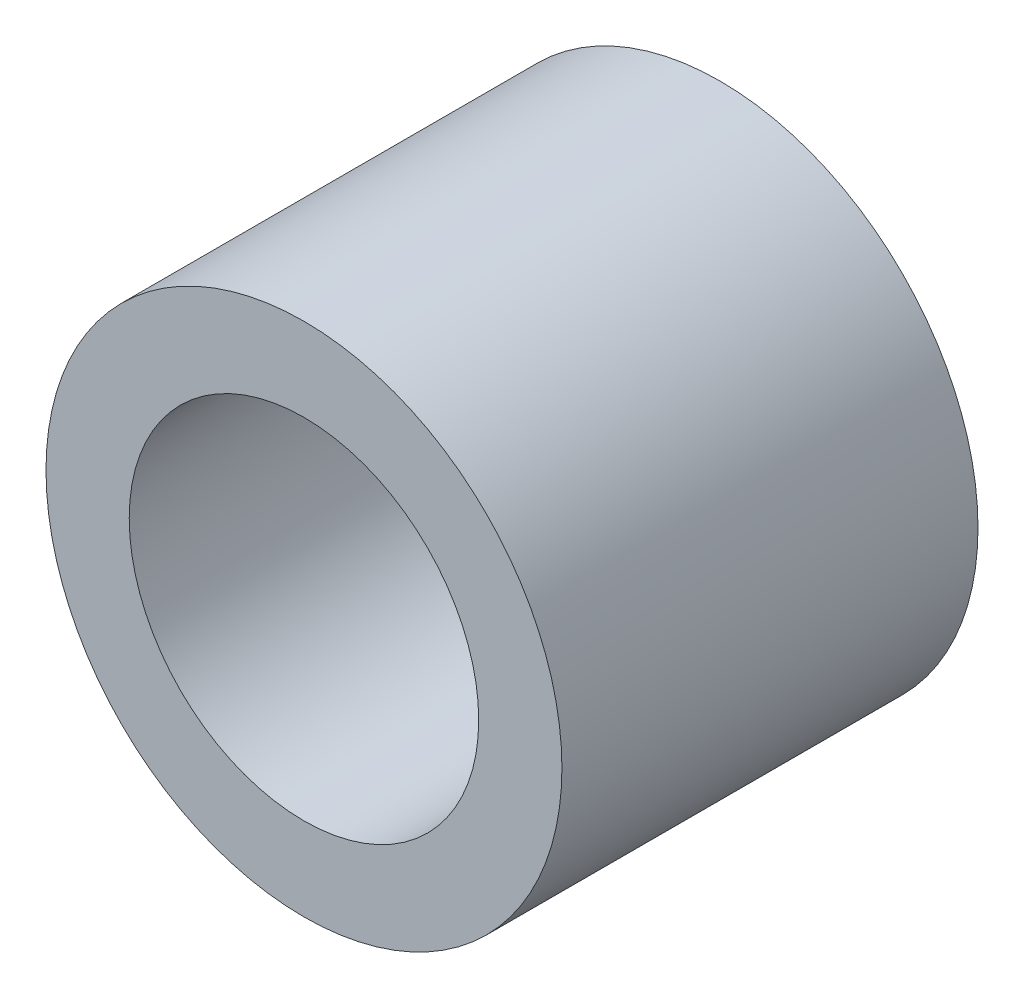
ISO-10303-21;
HEADER;
FILE_DESCRIPTION(('STEP AP214'),'2;1');
FILE_NAME('part.step','',(''),(''),'','','');
FILE_SCHEMA(('AUTOMOTIVE_DESIGN { 1 0 10303 214 1 1 1 1 }'));
ENDSEC;
DATA;
#1=APPLICATION_CONTEXT('core data for automotive mechanical design processes');
#2=APPLICATION_PROTOCOL_DEFINITION('international standard','automotive_design',2000,#1);
#3=PRODUCT_CONTEXT('',#1,'mechanical');
#4=PRODUCT('Part','Part','',(#3));
#5=PRODUCT_RELATED_PRODUCT_CATEGORY('part','',(#4));
#6=PRODUCT_DEFINITION_FORMATION('','',#4);
#7=PRODUCT_DEFINITION_CONTEXT('part definition',#1,'design');
#8=PRODUCT_DEFINITION('design','',#6,#7);
#9=PRODUCT_DEFINITION_SHAPE('','',#8);
#10=(LENGTH_UNIT() NAMED_UNIT(*) SI_UNIT(.MILLI.,.METRE.));
#11=(NAMED_UNIT(*) PLANE_ANGLE_UNIT() SI_UNIT($,.RADIAN.));
#12=(NAMED_UNIT(*) SI_UNIT($,.STERADIAN.) SOLID_ANGLE_UNIT());
#13=UNCERTAINTY_MEASURE_WITH_UNIT(LENGTH_MEASURE(1.E-05),#10,'distance_accuracy_value','');
#14=(GEOMETRIC_REPRESENTATION_CONTEXT(3) GLOBAL_UNCERTAINTY_ASSIGNED_CONTEXT((#13)) GLOBAL_UNIT_ASSIGNED_CONTEXT((#10,
#11,#12)) REPRESENTATION_CONTEXT('',''));
#15=CARTESIAN_POINT('',(0.,0.,0.));
#16=DIRECTION('',(0.,0.,1.));
#17=DIRECTION('',(1.,0.,0.));
#18=AXIS2_PLACEMENT_3D('',#15,#16,#17);
#19=CARTESIAN_POINT('',(0.,0.,5.));
#20=DIRECTION('',(0.,0.,1.));
#21=DIRECTION('',(1.,0.,0.));
#22=AXIS2_PLACEMENT_3D('',#19,#20,#21);
#23=PLANE('',#22);
#24=CARTESIAN_POINT('',(0.,0.,5.));
#25=DIRECTION('',(0.,0.,1.));
#26=DIRECTION('',(1.,0.,0.));
#27=AXIS2_PLACEMENT_3D('',#24,#25,#26);
#28=CIRCLE('',#27,3.1);
#29=CARTESIAN_POINT('',(3.1,0.,5.));
#30=VERTEX_POINT('',#29);
#31=EDGE_CURVE('E10',#30,#30,#28,.T.);
#32=ORIENTED_EDGE('',*,*,#31,.T.);
#33=EDGE_LOOP('',(#32));
#34=FACE_BOUND('',#33,.T.);
#35=CARTESIAN_POINT('',(0.,0.,5.));
#36=DIRECTION('',(0.,0.,1.));
#37=DIRECTION('',(1.,0.,0.));
#38=AXIS2_PLACEMENT_3D('',#35,#36,#37);
#39=CIRCLE('',#38,2.1);
#40=CARTESIAN_POINT('',(2.1,0.,5.));
#41=VERTEX_POINT('',#40);
#42=EDGE_CURVE('E43',#41,#41,#39,.T.);
#43=ORIENTED_EDGE('',*,*,#42,.F.);
#44=EDGE_LOOP('',(#43));
#45=FACE_BOUND('',#44,.T.);
#46=ADVANCED_FACE('F32',(#34,#45),#23,.T.);
#47=CARTESIAN_POINT('',(0.,0.,0.));
#48=DIRECTION('',(0.,0.,1.));
#49=DIRECTION('',(1.,0.,0.));
#50=AXIS2_PLACEMENT_3D('',#47,#48,#49);
#51=PLANE('',#50);
#52=CARTESIAN_POINT('',(0.,0.,0.));
#53=DIRECTION('',(0.,0.,1.));
#54=DIRECTION('',(1.,0.,0.));
#55=AXIS2_PLACEMENT_3D('',#52,#53,#54);
#56=CIRCLE('',#55,3.1);
#57=CARTESIAN_POINT('',(3.1,0.,0.));
#58=VERTEX_POINT('',#57);
#59=EDGE_CURVE('E36',#58,#58,#56,.T.);
#60=ORIENTED_EDGE('',*,*,#59,.F.);
#61=EDGE_LOOP('',(#60));
#62=FACE_BOUND('',#61,.T.);
#63=CARTESIAN_POINT('',(0.,0.,0.));
#64=DIRECTION('',(0.,0.,1.));
#65=DIRECTION('',(1.,0.,0.));
#66=AXIS2_PLACEMENT_3D('',#63,#64,#65);
#67=CIRCLE('',#66,2.1);
#68=CARTESIAN_POINT('',(2.1,0.,0.));
#69=VERTEX_POINT('',#68);
#70=EDGE_CURVE('E45',#69,#69,#67,.T.);
#71=ORIENTED_EDGE('',*,*,#70,.T.);
#72=EDGE_LOOP('',(#71));
#73=FACE_BOUND('',#72,.T.);
#74=ADVANCED_FACE('F55',(#62,#73),#51,.F.);
#75=CARTESIAN_POINT('',(0.,0.,5.));
#76=DIRECTION('',(0.,0.,-1.));
#77=DIRECTION('',(-1.,0.,0.));
#78=AXIS2_PLACEMENT_3D('',#75,#76,#77);
#79=CYLINDRICAL_SURFACE('',#78,3.1);
#80=ORIENTED_EDGE('',*,*,#31,.F.);
#81=EDGE_LOOP('',(#80));
#82=FACE_BOUND('',#81,.T.);
#83=ORIENTED_EDGE('',*,*,#59,.T.);
#84=EDGE_LOOP('',(#83));
#85=FACE_BOUND('',#84,.T.);
#86=ADVANCED_FACE('F34',(#82,#85),#79,.T.);
#87=CARTESIAN_POINT('',(0.,0.,5.));
#88=DIRECTION('',(0.,0.,-1.));
#89=DIRECTION('',(-1.,0.,0.));
#90=AXIS2_PLACEMENT_3D('',#87,#88,#89);
#91=CYLINDRICAL_SURFACE('',#90,2.1);
#92=ORIENTED_EDGE('',*,*,#42,.T.);
#93=EDGE_LOOP('',(#92));
#94=FACE_BOUND('',#93,.T.);
#95=ORIENTED_EDGE('',*,*,#70,.F.);
#96=EDGE_LOOP('',(#95));
#97=FACE_BOUND('',#96,.T.);
#98=ADVANCED_FACE('F51',(#94,#97),#91,.F.);
#99=CLOSED_SHELL('',(#46,#74,#86,#98));
#100=MANIFOLD_SOLID_BREP('B2',#99);
#101=ADVANCED_BREP_SHAPE_REPRESENTATION('',(#18,#100),#14);
#102=SHAPE_DEFINITION_REPRESENTATION(#9,#101);
ENDSEC;
END-ISO-10303-21;
